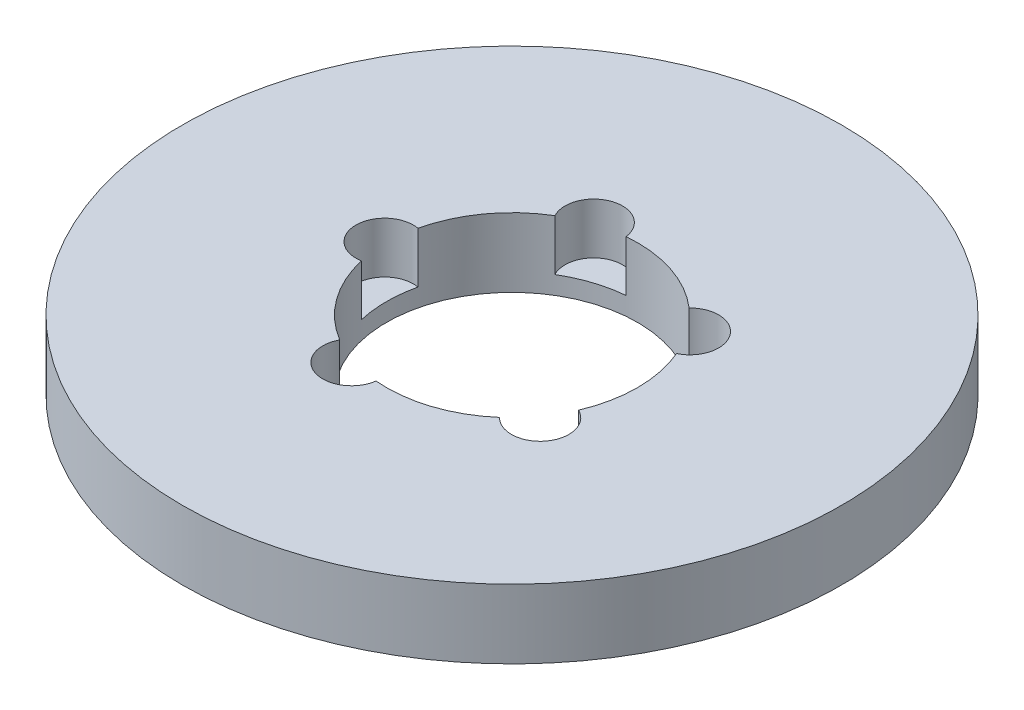
ISO-10303-21;
HEADER;
FILE_DESCRIPTION(('STEP AP214'),'2;1');
FILE_NAME('part.step','',(''),(''),'','','');
FILE_SCHEMA(('AUTOMOTIVE_DESIGN { 1 0 10303 214 1 1 1 1 }'));
ENDSEC;
DATA;
#1=APPLICATION_CONTEXT('core data for automotive mechanical design processes');
#2=APPLICATION_PROTOCOL_DEFINITION('international standard','automotive_design',2000,#1);
#3=PRODUCT_CONTEXT('',#1,'mechanical');
#4=PRODUCT('Part','Part','',(#3));
#5=PRODUCT_RELATED_PRODUCT_CATEGORY('part','',(#4));
#6=PRODUCT_DEFINITION_FORMATION('','',#4);
#7=PRODUCT_DEFINITION_CONTEXT('part definition',#1,'design');
#8=PRODUCT_DEFINITION('design','',#6,#7);
#9=PRODUCT_DEFINITION_SHAPE('','',#8);
#10=(LENGTH_UNIT() NAMED_UNIT(*) SI_UNIT(.MILLI.,.METRE.));
#11=(NAMED_UNIT(*) PLANE_ANGLE_UNIT() SI_UNIT($,.RADIAN.));
#12=(NAMED_UNIT(*) SI_UNIT($,.STERADIAN.) SOLID_ANGLE_UNIT());
#13=UNCERTAINTY_MEASURE_WITH_UNIT(LENGTH_MEASURE(1.E-05),#10,'distance_accuracy_value','');
#14=(GEOMETRIC_REPRESENTATION_CONTEXT(3) GLOBAL_UNCERTAINTY_ASSIGNED_CONTEXT((#13)) GLOBAL_UNIT_ASSIGNED_CONTEXT((#10,
#11,#12)) REPRESENTATION_CONTEXT('',''));
#15=CARTESIAN_POINT('',(0.,0.,0.));
#16=DIRECTION('',(0.,0.,1.));
#17=DIRECTION('',(1.,0.,0.));
#18=AXIS2_PLACEMENT_3D('',#15,#16,#17);
#19=CARTESIAN_POINT('',(0.,11.,0.));
#20=DIRECTION('',(0.,-1.,0.));
#21=DIRECTION('',(0.,0.,-1.));
#22=AXIS2_PLACEMENT_3D('',#19,#20,#21);
#23=CYLINDRICAL_SURFACE('',#22,52.5);
#24=CARTESIAN_POINT('',(0.,11.,0.));
#25=DIRECTION('',(0.,1.,0.));
#26=DIRECTION('',(0.,0.,1.));
#27=AXIS2_PLACEMENT_3D('',#24,#25,#26);
#28=CIRCLE('',#27,52.5);
#29=CARTESIAN_POINT('',(0.,11.,52.5));
#30=VERTEX_POINT('',#29);
#31=EDGE_CURVE('E157',#30,#30,#28,.T.);
#32=ORIENTED_EDGE('',*,*,#31,.F.);
#33=EDGE_LOOP('',(#32));
#34=FACE_BOUND('',#33,.T.);
#35=CARTESIAN_POINT('',(0.,0.,0.));
#36=DIRECTION('',(0.,1.,0.));
#37=DIRECTION('',(0.,0.,1.));
#38=AXIS2_PLACEMENT_3D('',#35,#36,#37);
#39=CIRCLE('',#38,52.5);
#40=CARTESIAN_POINT('',(0.,0.,52.5));
#41=VERTEX_POINT('',#40);
#42=EDGE_CURVE('E150',#41,#41,#39,.T.);
#43=ORIENTED_EDGE('',*,*,#42,.T.);
#44=EDGE_LOOP('',(#43));
#45=FACE_BOUND('',#44,.T.);
#46=ADVANCED_FACE('F39',(#34,#45),#23,.T.);
#47=CARTESIAN_POINT('',(0.,11.,0.));
#48=DIRECTION('',(0.,1.,0.));
#49=DIRECTION('',(0.,0.,1.));
#50=AXIS2_PLACEMENT_3D('',#47,#48,#49);
#51=PLANE('',#50);
#52=CARTESIAN_POINT('',(-6.27069930520976,11.,-19.2992280182196));
#53=DIRECTION('',(0.,1.,0.));
#54=DIRECTION('',(-0.95105651629515,0.,0.309016994374958));
#55=AXIS2_PLACEMENT_3D('',#52,#53,#54);
#56=CIRCLE('',#55,4.575923697531);
#57=CARTESIAN_POINT('',(-1.73767860619094,11.,-19.9243688246726));
#58=VERTEX_POINT('',#57);
#59=CARTESIAN_POINT('',(-10.3054386332086,11.,-17.1405348392975));
#60=VERTEX_POINT('',#59);
#61=EDGE_CURVE('E194',#58,#60,#56,.T.);
#62=ORIENTED_EDGE('',*,*,#61,.F.);
#63=CARTESIAN_POINT('',(0.,11.,0.));
#64=DIRECTION('',(0.,1.,0.));
#65=DIRECTION('',(0.,0.,1.));
#66=AXIS2_PLACEMENT_3D('',#63,#64,#65);
#67=CIRCLE('',#66,20.);
#68=CARTESIAN_POINT('',(13.1170616795484,11.,-15.0977711234116));
#69=VERTEX_POINT('',#68);
#70=EDGE_CURVE('E147',#69,#58,#67,.T.);
#71=ORIENTED_EDGE('',*,*,#70,.F.);
#72=CARTESIAN_POINT('',(16.4169039142688,11.,-11.9275788718942));
#73=DIRECTION('',(0.,1.,0.));
#74=DIRECTION('',(-0.58778525229248,0.,-0.809016994374942));
#75=AXIS2_PLACEMENT_3D('',#72,#73,#74);
#76=CIRCLE('',#75,4.575923697531);
#77=CARTESIAN_POINT('',(18.4122285836982,11.,-7.80959913066277));
#78=VERTEX_POINT('',#77);
#79=EDGE_CURVE('E254',#78,#69,#76,.T.);
#80=ORIENTED_EDGE('',*,*,#79,.F.);
#81=CARTESIAN_POINT('',(18.4122285836983,11.,7.8095991306625));
#82=VERTEX_POINT('',#81);
#83=EDGE_CURVE('E144',#82,#78,#67,.T.);
#84=ORIENTED_EDGE('',*,*,#83,.F.);
#85=CARTESIAN_POINT('',(16.416903914269,11.,11.927578871894));
#86=DIRECTION('',(0.,1.,0.));
#87=DIRECTION('',(0.587785252292469,0.,-0.809016994374951));
#88=AXIS2_PLACEMENT_3D('',#85,#86,#87);
#89=CIRCLE('',#88,4.575923697531);
#90=CARTESIAN_POINT('',(13.1170616795486,11.,15.0977711234114));
#91=VERTEX_POINT('',#90);
#92=EDGE_CURVE('E141',#91,#82,#89,.T.);
#93=ORIENTED_EDGE('',*,*,#92,.F.);
#94=CARTESIAN_POINT('',(-1.73767860619066,11.,19.9243688246726));
#95=VERTEX_POINT('',#94);
#96=EDGE_CURVE('E134',#95,#91,#67,.T.);
#97=ORIENTED_EDGE('',*,*,#96,.F.);
#98=CARTESIAN_POINT('',(-6.27069930520949,11.,19.2992280182197));
#99=DIRECTION('',(0.,1.,0.));
#100=DIRECTION('',(0.951056516295155,0.,0.309016994374945));
#101=AXIS2_PLACEMENT_3D('',#98,#99,#100);
#102=CIRCLE('',#101,4.575923697531);
#103=CARTESIAN_POINT('',(-10.3054386332084,11.,17.1405348392976));
#104=VERTEX_POINT('',#103);
#105=EDGE_CURVE('E111',#104,#95,#102,.T.);
#106=ORIENTED_EDGE('',*,*,#105,.F.);
#107=CARTESIAN_POINT('',(-19.4861730238476,11.,4.50433800737388));
#108=VERTEX_POINT('',#107);
#109=EDGE_CURVE('E145',#108,#104,#67,.T.);
#110=ORIENTED_EDGE('',*,*,#109,.F.);
#111=CARTESIAN_POINT('',(-20.2924092181188,11.,0.));
#112=DIRECTION('',(0.,1.,0.));
#113=DIRECTION('',(0.,0.,1.));
#114=AXIS2_PLACEMENT_3D('',#111,#112,#113);
#115=CIRCLE('',#114,4.575923697531);
#116=CARTESIAN_POINT('',(-19.4861730238476,11.,-4.50433800737388));
#117=VERTEX_POINT('',#116);
#118=EDGE_CURVE('E153',#117,#108,#115,.T.);
#119=ORIENTED_EDGE('',*,*,#118,.F.);
#120=EDGE_CURVE('E146',#60,#117,#67,.T.);
#121=ORIENTED_EDGE('',*,*,#120,.F.);
#122=EDGE_LOOP('',(#62,#71,#80,#84,#93,#97,#106,#110,#119,#121));
#123=FACE_BOUND('',#122,.T.);
#124=ORIENTED_EDGE('',*,*,#31,.T.);
#125=EDGE_LOOP('',(#124));
#126=FACE_BOUND('',#125,.T.);
#127=ADVANCED_FACE('F139',(#123,#126),#51,.T.);
#128=CARTESIAN_POINT('',(0.,0.,0.));
#129=DIRECTION('',(0.,1.,0.));
#130=DIRECTION('',(0.,0.,1.));
#131=AXIS2_PLACEMENT_3D('',#128,#129,#130);
#132=PLANE('',#131);
#133=CARTESIAN_POINT('',(0.,0.,0.));
#134=DIRECTION('',(0.,1.,0.));
#135=DIRECTION('',(0.,0.,1.));
#136=AXIS2_PLACEMENT_3D('',#133,#134,#135);
#137=CIRCLE('',#136,20.);
#138=CARTESIAN_POINT('',(0.,0.,20.));
#139=VERTEX_POINT('',#138);
#140=EDGE_CURVE('E154',#139,#139,#137,.T.);
#141=ORIENTED_EDGE('',*,*,#140,.T.);
#142=EDGE_LOOP('',(#141));
#143=FACE_BOUND('',#142,.T.);
#144=ORIENTED_EDGE('',*,*,#42,.F.);
#145=EDGE_LOOP('',(#144));
#146=FACE_BOUND('',#145,.T.);
#147=ADVANCED_FACE('F213',(#143,#146),#132,.F.);
#148=CARTESIAN_POINT('',(0.,11.,0.));
#149=DIRECTION('',(0.,-1.,0.));
#150=DIRECTION('',(0.,0.,-1.));
#151=AXIS2_PLACEMENT_3D('',#148,#149,#150);
#152=CYLINDRICAL_SURFACE('',#151,20.);
#153=DIRECTION('',(0.,1.,0.));
#154=VECTOR('',#153,1.);
#155=CARTESIAN_POINT('',(-1.73767860619094,6.93840193588257,-19.9243688246726));
#156=LINE('',#155,#154);
#157=CARTESIAN_POINT('',(-1.73767860619094,2.87680387176513,-19.9243688246726));
#158=VERTEX_POINT('',#157);
#159=EDGE_CURVE('E11',#158,#58,#156,.T.);
#160=ORIENTED_EDGE('',*,*,#159,.F.);
#161=CARTESIAN_POINT('',(0.,2.87680387176513,0.));
#162=DIRECTION('',(0.,1.,0.));
#163=DIRECTION('',(0.,0.,1.));
#164=AXIS2_PLACEMENT_3D('',#161,#162,#163);
#165=CIRCLE('',#164,20.);
#166=CARTESIAN_POINT('',(-10.3054386332086,2.87680387176513,-17.1405348392975));
#167=VERTEX_POINT('',#166);
#168=EDGE_CURVE('E189',#158,#167,#165,.T.);
#169=ORIENTED_EDGE('',*,*,#168,.T.);
#170=DIRECTION('',(0.,1.,0.));
#171=VECTOR('',#170,1.);
#172=CARTESIAN_POINT('',(-10.3054386332086,6.93840193588257,-17.1405348392975));
#173=LINE('',#172,#171);
#174=EDGE_CURVE('E46',#60,#167,#173,.F.);
#175=ORIENTED_EDGE('',*,*,#174,.F.);
#176=ORIENTED_EDGE('',*,*,#120,.T.);
#177=DIRECTION('',(0.,1.,0.));
#178=VECTOR('',#177,1.);
#179=CARTESIAN_POINT('',(-19.4861730238476,6.93840193588257,-4.50433800737388));
#180=LINE('',#179,#178);
#181=CARTESIAN_POINT('',(-19.4861730238476,2.87680387176513,-4.50433800737388));
#182=VERTEX_POINT('',#181);
#183=EDGE_CURVE('E168',#182,#117,#180,.T.);
#184=ORIENTED_EDGE('',*,*,#183,.F.);
#185=CARTESIAN_POINT('',(0.,2.87680387176513,0.));
#186=DIRECTION('',(0.,1.,0.));
#187=DIRECTION('',(0.,0.,1.));
#188=AXIS2_PLACEMENT_3D('',#185,#186,#187);
#189=CIRCLE('',#188,20.);
#190=CARTESIAN_POINT('',(-19.4861730238476,2.87680387176513,4.50433800737388));
#191=VERTEX_POINT('',#190);
#192=EDGE_CURVE('E165',#182,#191,#189,.T.);
#193=ORIENTED_EDGE('',*,*,#192,.T.);
#194=DIRECTION('',(0.,1.,0.));
#195=VECTOR('',#194,1.);
#196=CARTESIAN_POINT('',(-19.4861730238476,6.93840193588257,4.50433800737388));
#197=LINE('',#196,#195);
#198=EDGE_CURVE('E170',#108,#191,#197,.F.);
#199=ORIENTED_EDGE('',*,*,#198,.F.);
#200=ORIENTED_EDGE('',*,*,#109,.T.);
#201=DIRECTION('',(0.,1.,0.));
#202=VECTOR('',#201,1.);
#203=CARTESIAN_POINT('',(-10.3054386332084,6.93840193588257,17.1405348392976));
#204=LINE('',#203,#202);
#205=CARTESIAN_POINT('',(-10.3054386332084,2.87680387176513,17.1405348392976));
#206=VERTEX_POINT('',#205);
#207=EDGE_CURVE('E121',#206,#104,#204,.T.);
#208=ORIENTED_EDGE('',*,*,#207,.F.);
#209=CARTESIAN_POINT('',(0.,2.87680387176513,0.));
#210=DIRECTION('',(0.,1.,0.));
#211=DIRECTION('',(0.,0.,1.));
#212=AXIS2_PLACEMENT_3D('',#209,#210,#211);
#213=CIRCLE('',#212,20.);
#214=CARTESIAN_POINT('',(-1.73767860619066,2.87680387176513,19.9243688246726));
#215=VERTEX_POINT('',#214);
#216=EDGE_CURVE('E136',#206,#215,#213,.T.);
#217=ORIENTED_EDGE('',*,*,#216,.T.);
#218=DIRECTION('',(0.,1.,0.));
#219=VECTOR('',#218,1.);
#220=CARTESIAN_POINT('',(-1.73767860619066,6.93840193588257,19.9243688246726));
#221=LINE('',#220,#219);
#222=EDGE_CURVE('E117',#95,#215,#221,.F.);
#223=ORIENTED_EDGE('',*,*,#222,.F.);
#224=ORIENTED_EDGE('',*,*,#96,.T.);
#225=DIRECTION('',(0.,1.,0.));
#226=VECTOR('',#225,1.);
#227=CARTESIAN_POINT('',(13.1170616795486,6.93840193588257,15.0977711234114));
#228=LINE('',#227,#226);
#229=CARTESIAN_POINT('',(13.1170616795486,2.87680387176513,15.0977711234114));
#230=VERTEX_POINT('',#229);
#231=EDGE_CURVE('E182',#230,#91,#228,.T.);
#232=ORIENTED_EDGE('',*,*,#231,.F.);
#233=CARTESIAN_POINT('',(0.,2.87680387176513,0.));
#234=DIRECTION('',(0.,1.,0.));
#235=DIRECTION('',(0.,0.,1.));
#236=AXIS2_PLACEMENT_3D('',#233,#234,#235);
#237=CIRCLE('',#236,20.);
#238=CARTESIAN_POINT('',(18.4122285836983,2.87680387176513,7.8095991306625));
#239=VERTEX_POINT('',#238);
#240=EDGE_CURVE('E174',#230,#239,#237,.T.);
#241=ORIENTED_EDGE('',*,*,#240,.T.);
#242=DIRECTION('',(0.,1.,0.));
#243=VECTOR('',#242,1.);
#244=CARTESIAN_POINT('',(18.4122285836983,6.93840193588257,7.8095991306625));
#245=LINE('',#244,#243);
#246=EDGE_CURVE('E177',#82,#239,#245,.F.);
#247=ORIENTED_EDGE('',*,*,#246,.F.);
#248=ORIENTED_EDGE('',*,*,#83,.T.);
#249=DIRECTION('',(0.,1.,0.));
#250=VECTOR('',#249,1.);
#251=CARTESIAN_POINT('',(18.4122285836982,6.93840193588257,-7.80959913066277));
#252=LINE('',#251,#250);
#253=CARTESIAN_POINT('',(18.4122285836982,2.87680387176513,-7.80959913066277));
#254=VERTEX_POINT('',#253);
#255=EDGE_CURVE('E187',#254,#78,#252,.T.);
#256=ORIENTED_EDGE('',*,*,#255,.F.);
#257=CARTESIAN_POINT('',(0.,2.87680387176513,0.));
#258=DIRECTION('',(0.,1.,0.));
#259=DIRECTION('',(0.,0.,1.));
#260=AXIS2_PLACEMENT_3D('',#257,#258,#259);
#261=CIRCLE('',#260,20.);
#262=CARTESIAN_POINT('',(13.1170616795484,2.87680387176513,-15.0977711234116));
#263=VERTEX_POINT('',#262);
#264=EDGE_CURVE('E181',#254,#263,#261,.T.);
#265=ORIENTED_EDGE('',*,*,#264,.T.);
#266=DIRECTION('',(0.,1.,0.));
#267=VECTOR('',#266,1.);
#268=CARTESIAN_POINT('',(13.1170616795484,6.93840193588257,-15.0977711234116));
#269=LINE('',#268,#267);
#270=EDGE_CURVE('E186',#69,#263,#269,.F.);
#271=ORIENTED_EDGE('',*,*,#270,.F.);
#272=ORIENTED_EDGE('',*,*,#70,.T.);
#273=EDGE_LOOP('',(#160,#169,#175,#176,#184,#193,#199,#200,#208,#217,#223,#224,#232,#241,#247,
#248,#256,#265,#271,#272));
#274=FACE_BOUND('',#273,.T.);
#275=ORIENTED_EDGE('',*,*,#140,.F.);
#276=EDGE_LOOP('',(#275));
#277=FACE_BOUND('',#276,.T.);
#278=ADVANCED_FACE('F135',(#274,#277),#152,.F.);
#279=CARTESIAN_POINT('',(-20.2924092181188,2.87680387176513,0.));
#280=DIRECTION('',(0.,1.,0.));
#281=DIRECTION('',(0.,0.,1.));
#282=AXIS2_PLACEMENT_3D('',#279,#280,#281);
#283=CYLINDRICAL_SURFACE('',#282,4.575923697531);
#284=ORIENTED_EDGE('',*,*,#183,.T.);
#285=ORIENTED_EDGE('',*,*,#118,.T.);
#286=ORIENTED_EDGE('',*,*,#198,.T.);
#287=CARTESIAN_POINT('',(-20.2924092181188,2.87680387176513,0.));
#288=DIRECTION('',(0.,1.,0.));
#289=DIRECTION('',(0.,0.,1.));
#290=AXIS2_PLACEMENT_3D('',#287,#288,#289);
#291=CIRCLE('',#290,4.575923697531);
#292=EDGE_CURVE('E158',#182,#191,#291,.T.);
#293=ORIENTED_EDGE('',*,*,#292,.F.);
#294=EDGE_LOOP('',(#284,#285,#286,#293));
#295=FACE_BOUND('',#294,.T.);
#296=ADVANCED_FACE('F221',(#295),#283,.F.);
#297=CARTESIAN_POINT('',(-20.2924092181188,2.87680387176513,0.));
#298=DIRECTION('',(0.,1.,0.));
#299=DIRECTION('',(0.,0.,1.));
#300=AXIS2_PLACEMENT_3D('',#297,#298,#299);
#301=PLANE('',#300);
#302=ORIENTED_EDGE('',*,*,#292,.T.);
#303=ORIENTED_EDGE('',*,*,#192,.F.);
#304=EDGE_LOOP('',(#302,#303));
#305=FACE_BOUND('',#304,.T.);
#306=ADVANCED_FACE('F227',(#305),#301,.T.);
#307=CARTESIAN_POINT('',(-6.27069930520949,2.87680387176513,19.2992280182197));
#308=DIRECTION('',(0.,1.,0.));
#309=DIRECTION('',(0.,0.,1.));
#310=AXIS2_PLACEMENT_3D('',#307,#308,#309);
#311=CYLINDRICAL_SURFACE('',#310,4.575923697531);
#312=ORIENTED_EDGE('',*,*,#207,.T.);
#313=ORIENTED_EDGE('',*,*,#105,.T.);
#314=ORIENTED_EDGE('',*,*,#222,.T.);
#315=CARTESIAN_POINT('',(-6.27069930520949,2.87680387176513,19.2992280182197));
#316=DIRECTION('',(0.,1.,0.));
#317=DIRECTION('',(0.951056516295155,0.,0.309016994374945));
#318=AXIS2_PLACEMENT_3D('',#315,#316,#317);
#319=CIRCLE('',#318,4.575923697531);
#320=EDGE_CURVE('E127',#206,#215,#319,.T.);
#321=ORIENTED_EDGE('',*,*,#320,.F.);
#322=EDGE_LOOP('',(#312,#313,#314,#321));
#323=FACE_BOUND('',#322,.T.);
#324=ADVANCED_FACE('F116',(#323),#311,.F.);
#325=CARTESIAN_POINT('',(-6.27069930520949,2.87680387176513,19.2992280182197));
#326=DIRECTION('',(0.,1.,0.));
#327=DIRECTION('',(0.951056516295155,0.,0.309016994374945));
#328=AXIS2_PLACEMENT_3D('',#325,#326,#327);
#329=PLANE('',#328);
#330=ORIENTED_EDGE('',*,*,#320,.T.);
#331=ORIENTED_EDGE('',*,*,#216,.F.);
#332=EDGE_LOOP('',(#330,#331));
#333=FACE_BOUND('',#332,.T.);
#334=ADVANCED_FACE('F234',(#333),#329,.T.);
#335=CARTESIAN_POINT('',(16.416903914269,2.87680387176513,11.927578871894));
#336=DIRECTION('',(0.,1.,0.));
#337=DIRECTION('',(0.,0.,1.));
#338=AXIS2_PLACEMENT_3D('',#335,#336,#337);
#339=CYLINDRICAL_SURFACE('',#338,4.575923697531);
#340=ORIENTED_EDGE('',*,*,#231,.T.);
#341=ORIENTED_EDGE('',*,*,#92,.T.);
#342=ORIENTED_EDGE('',*,*,#246,.T.);
#343=CARTESIAN_POINT('',(16.416903914269,2.87680387176513,11.927578871894));
#344=DIRECTION('',(0.,1.,0.));
#345=DIRECTION('',(0.587785252292469,0.,-0.809016994374951));
#346=AXIS2_PLACEMENT_3D('',#343,#344,#345);
#347=CIRCLE('',#346,4.575923697531);
#348=EDGE_CURVE('E130',#230,#239,#347,.T.);
#349=ORIENTED_EDGE('',*,*,#348,.F.);
#350=EDGE_LOOP('',(#340,#341,#342,#349));
#351=FACE_BOUND('',#350,.T.);
#352=ADVANCED_FACE('F240',(#351),#339,.F.);
#353=CARTESIAN_POINT('',(16.416903914269,2.87680387176513,11.927578871894));
#354=DIRECTION('',(0.,1.,0.));
#355=DIRECTION('',(0.587785252292469,0.,-0.809016994374951));
#356=AXIS2_PLACEMENT_3D('',#353,#354,#355);
#357=PLANE('',#356);
#358=ORIENTED_EDGE('',*,*,#348,.T.);
#359=ORIENTED_EDGE('',*,*,#240,.F.);
#360=EDGE_LOOP('',(#358,#359));
#361=FACE_BOUND('',#360,.T.);
#362=ADVANCED_FACE('F245',(#361),#357,.T.);
#363=CARTESIAN_POINT('',(16.4169039142688,2.87680387176513,-11.9275788718942));
#364=DIRECTION('',(0.,1.,0.));
#365=DIRECTION('',(0.,0.,1.));
#366=AXIS2_PLACEMENT_3D('',#363,#364,#365);
#367=CYLINDRICAL_SURFACE('',#366,4.575923697531);
#368=ORIENTED_EDGE('',*,*,#255,.T.);
#369=ORIENTED_EDGE('',*,*,#79,.T.);
#370=ORIENTED_EDGE('',*,*,#270,.T.);
#371=CARTESIAN_POINT('',(16.4169039142688,2.87680387176513,-11.9275788718942));
#372=DIRECTION('',(0.,1.,0.));
#373=DIRECTION('',(-0.58778525229248,0.,-0.809016994374942));
#374=AXIS2_PLACEMENT_3D('',#371,#372,#373);
#375=CIRCLE('',#374,4.575923697531);
#376=EDGE_CURVE('E56',#254,#263,#375,.T.);
#377=ORIENTED_EDGE('',*,*,#376,.F.);
#378=EDGE_LOOP('',(#368,#369,#370,#377));
#379=FACE_BOUND('',#378,.T.);
#380=ADVANCED_FACE('F266',(#379),#367,.F.);
#381=CARTESIAN_POINT('',(16.4169039142688,2.87680387176513,-11.9275788718942));
#382=DIRECTION('',(0.,1.,0.));
#383=DIRECTION('',(-0.58778525229248,0.,-0.809016994374942));
#384=AXIS2_PLACEMENT_3D('',#381,#382,#383);
#385=PLANE('',#384);
#386=ORIENTED_EDGE('',*,*,#376,.T.);
#387=ORIENTED_EDGE('',*,*,#264,.F.);
#388=EDGE_LOOP('',(#386,#387));
#389=FACE_BOUND('',#388,.T.);
#390=ADVANCED_FACE('F204',(#389),#385,.T.);
#391=CARTESIAN_POINT('',(-6.27069930520976,2.87680387176513,-19.2992280182196));
#392=DIRECTION('',(0.,1.,0.));
#393=DIRECTION('',(0.,0.,1.));
#394=AXIS2_PLACEMENT_3D('',#391,#392,#393);
#395=CYLINDRICAL_SURFACE('',#394,4.575923697531);
#396=ORIENTED_EDGE('',*,*,#159,.T.);
#397=ORIENTED_EDGE('',*,*,#61,.T.);
#398=ORIENTED_EDGE('',*,*,#174,.T.);
#399=CARTESIAN_POINT('',(-6.27069930520976,2.87680387176513,-19.2992280182196));
#400=DIRECTION('',(0.,1.,0.));
#401=DIRECTION('',(-0.95105651629515,0.,0.309016994374958));
#402=AXIS2_PLACEMENT_3D('',#399,#400,#401);
#403=CIRCLE('',#402,4.575923697531);
#404=EDGE_CURVE('E55',#158,#167,#403,.T.);
#405=ORIENTED_EDGE('',*,*,#404,.F.);
#406=EDGE_LOOP('',(#396,#397,#398,#405));
#407=FACE_BOUND('',#406,.T.);
#408=ADVANCED_FACE('F193',(#407),#395,.F.);
#409=CARTESIAN_POINT('',(-6.27069930520976,2.87680387176513,-19.2992280182196));
#410=DIRECTION('',(0.,1.,0.));
#411=DIRECTION('',(-0.95105651629515,0.,0.309016994374958));
#412=AXIS2_PLACEMENT_3D('',#409,#410,#411);
#413=PLANE('',#412);
#414=ORIENTED_EDGE('',*,*,#404,.T.);
#415=ORIENTED_EDGE('',*,*,#168,.F.);
#416=EDGE_LOOP('',(#414,#415));
#417=FACE_BOUND('',#416,.T.);
#418=ADVANCED_FACE('F196',(#417),#413,.T.);
#419=CLOSED_SHELL('',(#46,#127,#147,#278,#296,#306,#324,#334,#352,#362,#380,#390,#408,#418));
#420=MANIFOLD_SOLID_BREP('B2',#419);
#421=ADVANCED_BREP_SHAPE_REPRESENTATION('',(#18,#420),#14);
#422=SHAPE_DEFINITION_REPRESENTATION(#9,#421);
ENDSEC;
END-ISO-10303-21;
